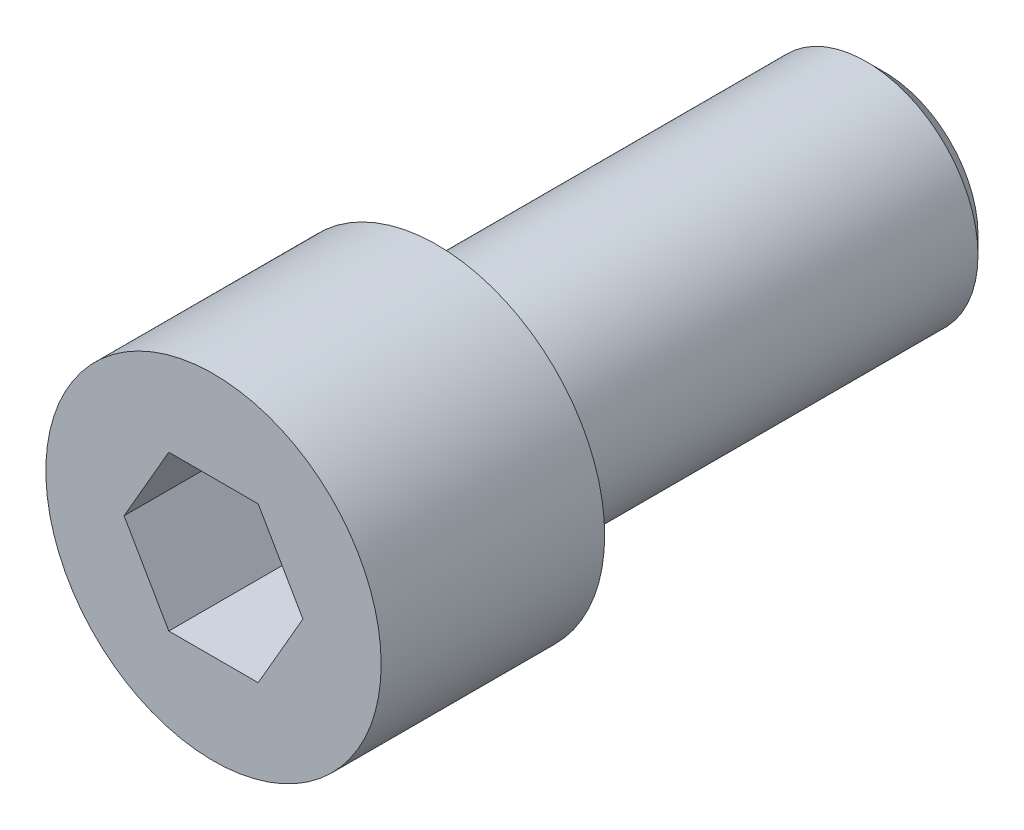
ISO-10303-21;
HEADER;
FILE_DESCRIPTION(('STEP AP214'),'2;1');
FILE_NAME('part.step','',(''),(''),'','','');
FILE_SCHEMA(('AUTOMOTIVE_DESIGN { 1 0 10303 214 1 1 1 1 }'));
ENDSEC;
DATA;
#1=APPLICATION_CONTEXT('core data for automotive mechanical design processes');
#2=APPLICATION_PROTOCOL_DEFINITION('international standard','automotive_design',2000,#1);
#3=PRODUCT_CONTEXT('',#1,'mechanical');
#4=PRODUCT('Part','Part','',(#3));
#5=PRODUCT_RELATED_PRODUCT_CATEGORY('part','',(#4));
#6=PRODUCT_DEFINITION_FORMATION('','',#4);
#7=PRODUCT_DEFINITION_CONTEXT('part definition',#1,'design');
#8=PRODUCT_DEFINITION('design','',#6,#7);
#9=PRODUCT_DEFINITION_SHAPE('','',#8);
#10=(LENGTH_UNIT() NAMED_UNIT(*) SI_UNIT(.MILLI.,.METRE.));
#11=(NAMED_UNIT(*) PLANE_ANGLE_UNIT() SI_UNIT($,.RADIAN.));
#12=(NAMED_UNIT(*) SI_UNIT($,.STERADIAN.) SOLID_ANGLE_UNIT());
#13=UNCERTAINTY_MEASURE_WITH_UNIT(LENGTH_MEASURE(1.E-05),#10,'distance_accuracy_value','');
#14=(GEOMETRIC_REPRESENTATION_CONTEXT(3) GLOBAL_UNCERTAINTY_ASSIGNED_CONTEXT((#13)) GLOBAL_UNIT_ASSIGNED_CONTEXT((#10,
#11,#12)) REPRESENTATION_CONTEXT('',''));
#15=CARTESIAN_POINT('',(0.,0.,0.));
#16=DIRECTION('',(0.,0.,1.));
#17=DIRECTION('',(1.,0.,0.));
#18=AXIS2_PLACEMENT_3D('',#15,#16,#17);
#19=CARTESIAN_POINT('',(0.,0.,0.));
#20=DIRECTION('',(0.,0.,1.));
#21=DIRECTION('',(1.,0.,0.));
#22=AXIS2_PLACEMENT_3D('',#19,#20,#21);
#23=PLANE('',#22);
#24=DIRECTION('',(0.5,0.866025403784439,0.));
#25=VECTOR('',#24,1.);
#26=CARTESIAN_POINT('',(0.5,-0.866025403784439,0.));
#27=LINE('',#26,#25);
#28=CARTESIAN_POINT('',(0.5,-0.866025403784439,0.));
#29=VERTEX_POINT('',#28);
#30=CARTESIAN_POINT('',(1.,0.,0.));
#31=VERTEX_POINT('',#30);
#32=EDGE_CURVE('E51',#29,#31,#27,.T.);
#33=ORIENTED_EDGE('',*,*,#32,.F.);
#34=DIRECTION('',(1.,0.,0.));
#35=VECTOR('',#34,1.);
#36=CARTESIAN_POINT('',(-0.5,-0.866025403784439,0.));
#37=LINE('',#36,#35);
#38=CARTESIAN_POINT('',(-0.5,-0.866025403784439,0.));
#39=VERTEX_POINT('',#38);
#40=EDGE_CURVE('E134',#39,#29,#37,.T.);
#41=ORIENTED_EDGE('',*,*,#40,.F.);
#42=DIRECTION('',(0.5,-0.866025403784439,0.));
#43=VECTOR('',#42,1.);
#44=CARTESIAN_POINT('',(-1.,0.,0.));
#45=LINE('',#44,#43);
#46=CARTESIAN_POINT('',(-1.,0.,0.));
#47=VERTEX_POINT('',#46);
#48=EDGE_CURVE('E132',#47,#39,#45,.T.);
#49=ORIENTED_EDGE('',*,*,#48,.F.);
#50=DIRECTION('',(-0.5,-0.866025403784439,0.));
#51=VECTOR('',#50,1.);
#52=CARTESIAN_POINT('',(-0.5,0.866025403784439,0.));
#53=LINE('',#52,#51);
#54=CARTESIAN_POINT('',(-0.5,0.866025403784439,0.));
#55=VERTEX_POINT('',#54);
#56=EDGE_CURVE('E99',#55,#47,#53,.T.);
#57=ORIENTED_EDGE('',*,*,#56,.F.);
#58=DIRECTION('',(-1.,0.,0.));
#59=VECTOR('',#58,1.);
#60=CARTESIAN_POINT('',(0.5,0.866025403784439,0.));
#61=LINE('',#60,#59);
#62=CARTESIAN_POINT('',(0.5,0.866025403784439,0.));
#63=VERTEX_POINT('',#62);
#64=EDGE_CURVE('E128',#63,#55,#61,.T.);
#65=ORIENTED_EDGE('',*,*,#64,.F.);
#66=DIRECTION('',(-0.5,0.866025403784439,0.));
#67=VECTOR('',#66,1.);
#68=CARTESIAN_POINT('',(1.,0.,0.));
#69=LINE('',#68,#67);
#70=EDGE_CURVE('E125',#31,#63,#69,.T.);
#71=ORIENTED_EDGE('',*,*,#70,.F.);
#72=EDGE_LOOP('',(#33,#41,#49,#57,#65,#71));
#73=FACE_BOUND('',#72,.T.);
#74=CARTESIAN_POINT('',(0.,0.,0.));
#75=DIRECTION('',(0.,0.,1.));
#76=DIRECTION('',(1.,0.,0.));
#77=AXIS2_PLACEMENT_3D('',#74,#75,#76);
#78=CIRCLE('',#77,1.875);
#79=CARTESIAN_POINT('',(1.875,0.,0.));
#80=VERTEX_POINT('',#79);
#81=EDGE_CURVE('E146',#80,#80,#78,.T.);
#82=ORIENTED_EDGE('',*,*,#81,.T.);
#83=EDGE_LOOP('',(#82));
#84=FACE_BOUND('',#83,.T.);
#85=ADVANCED_FACE('F35',(#73,#84),#23,.T.);
#86=CARTESIAN_POINT('',(0.,0.,-2.5));
#87=DIRECTION('',(0.,0.,1.));
#88=DIRECTION('',(1.,0.,0.));
#89=AXIS2_PLACEMENT_3D('',#86,#87,#88);
#90=CYLINDRICAL_SURFACE('',#89,1.875);
#91=CARTESIAN_POINT('',(0.,0.,-2.5));
#92=DIRECTION('',(0.,0.,1.));
#93=DIRECTION('',(1.,0.,0.));
#94=AXIS2_PLACEMENT_3D('',#91,#92,#93);
#95=CIRCLE('',#94,1.875);
#96=CARTESIAN_POINT('',(1.875,0.,-2.5));
#97=VERTEX_POINT('',#96);
#98=EDGE_CURVE('E138',#97,#97,#95,.T.);
#99=ORIENTED_EDGE('',*,*,#98,.T.);
#100=EDGE_LOOP('',(#99));
#101=FACE_BOUND('',#100,.T.);
#102=ORIENTED_EDGE('',*,*,#81,.F.);
#103=EDGE_LOOP('',(#102));
#104=FACE_BOUND('',#103,.T.);
#105=ADVANCED_FACE('F169',(#101,#104),#90,.T.);
#106=CARTESIAN_POINT('',(0.,0.,-2.5));
#107=DIRECTION('',(0.,0.,1.));
#108=DIRECTION('',(1.,0.,0.));
#109=AXIS2_PLACEMENT_3D('',#106,#107,#108);
#110=PLANE('',#109);
#111=CARTESIAN_POINT('',(0.,0.,-2.5));
#112=DIRECTION('',(0.,0.,1.));
#113=DIRECTION('',(1.,0.,0.));
#114=AXIS2_PLACEMENT_3D('',#111,#112,#113);
#115=CIRCLE('',#114,1.4);
#116=CARTESIAN_POINT('',(1.4,0.,-2.5));
#117=VERTEX_POINT('',#116);
#118=EDGE_CURVE('E149',#117,#117,#115,.T.);
#119=ORIENTED_EDGE('',*,*,#118,.T.);
#120=EDGE_LOOP('',(#119));
#121=FACE_BOUND('',#120,.T.);
#122=ORIENTED_EDGE('',*,*,#98,.F.);
#123=EDGE_LOOP('',(#122));
#124=FACE_BOUND('',#123,.T.);
#125=ADVANCED_FACE('F175',(#121,#124),#110,.F.);
#126=CARTESIAN_POINT('',(0.,0.,-2.5));
#127=DIRECTION('',(0.,0.,1.));
#128=DIRECTION('',(1.,0.,0.));
#129=AXIS2_PLACEMENT_3D('',#126,#127,#128);
#130=CYLINDRICAL_SURFACE('',#129,1.25);
#131=CARTESIAN_POINT('',(0.,0.,-7.3));
#132=DIRECTION('',(0.,0.,1.));
#133=DIRECTION('',(1.,0.,0.));
#134=AXIS2_PLACEMENT_3D('',#131,#132,#133);
#135=CIRCLE('',#134,1.25);
#136=CARTESIAN_POINT('',(1.25,0.,-7.3));
#137=VERTEX_POINT('',#136);
#138=EDGE_CURVE('E44',#137,#137,#135,.T.);
#139=ORIENTED_EDGE('',*,*,#138,.T.);
#140=EDGE_LOOP('',(#139));
#141=FACE_BOUND('',#140,.T.);
#142=CARTESIAN_POINT('',(0.,0.,-2.65));
#143=DIRECTION('',(0.,0.,1.));
#144=DIRECTION('',(1.,0.,0.));
#145=AXIS2_PLACEMENT_3D('',#142,#143,#144);
#146=CIRCLE('',#145,1.25);
#147=CARTESIAN_POINT('',(1.25,0.,-2.65));
#148=VERTEX_POINT('',#147);
#149=EDGE_CURVE('E152',#148,#148,#146,.F.);
#150=ORIENTED_EDGE('',*,*,#149,.T.);
#151=EDGE_LOOP('',(#150));
#152=FACE_BOUND('',#151,.T.);
#153=ADVANCED_FACE('F157',(#141,#152),#130,.T.);
#154=CARTESIAN_POINT('',(0.,0.,-7.5));
#155=DIRECTION('',(0.,0.,1.));
#156=DIRECTION('',(1.,0.,0.));
#157=AXIS2_PLACEMENT_3D('',#154,#155,#156);
#158=PLANE('',#157);
#159=CARTESIAN_POINT('',(0.,0.,-7.5));
#160=DIRECTION('',(0.,0.,1.));
#161=DIRECTION('',(1.,0.,0.));
#162=AXIS2_PLACEMENT_3D('',#159,#160,#161);
#163=CIRCLE('',#162,1.05000000000001);
#164=CARTESIAN_POINT('',(1.05000000000001,0.,-7.5));
#165=VERTEX_POINT('',#164);
#166=EDGE_CURVE('E11',#165,#165,#163,.F.);
#167=ORIENTED_EDGE('',*,*,#166,.T.);
#168=EDGE_LOOP('',(#167));
#169=FACE_BOUND('',#168,.T.);
#170=ADVANCED_FACE('F185',(#169),#158,.F.);
#171=CARTESIAN_POINT('',(0.5,-0.866025403784439,-1.5));
#172=DIRECTION('',(0.866025403784439,-0.5,0.));
#173=DIRECTION('',(0.5,0.866025403784439,0.));
#174=AXIS2_PLACEMENT_3D('',#171,#172,#173);
#175=PLANE('',#174);
#176=ORIENTED_EDGE('',*,*,#32,.T.);
#177=DIRECTION('',(0.,0.,1.));
#178=VECTOR('',#177,1.);
#179=CARTESIAN_POINT('',(1.,0.,-1.5));
#180=LINE('',#179,#178);
#181=CARTESIAN_POINT('',(1.,0.,-1.5));
#182=VERTEX_POINT('',#181);
#183=EDGE_CURVE('E81',#182,#31,#180,.T.);
#184=ORIENTED_EDGE('',*,*,#183,.F.);
#185=DIRECTION('',(0.5,0.866025403784439,0.));
#186=VECTOR('',#185,1.);
#187=CARTESIAN_POINT('',(0.5,-0.866025403784439,-1.5));
#188=LINE('',#187,#186);
#189=CARTESIAN_POINT('',(0.5,-0.866025403784439,-1.5));
#190=VERTEX_POINT('',#189);
#191=EDGE_CURVE('E136',#190,#182,#188,.T.);
#192=ORIENTED_EDGE('',*,*,#191,.F.);
#193=DIRECTION('',(0.,0.,1.));
#194=VECTOR('',#193,1.);
#195=CARTESIAN_POINT('',(0.5,-0.866025403784439,-1.5));
#196=LINE('',#195,#194);
#197=EDGE_CURVE('E59',#190,#29,#196,.T.);
#198=ORIENTED_EDGE('',*,*,#197,.T.);
#199=EDGE_LOOP('',(#176,#184,#192,#198));
#200=FACE_BOUND('',#199,.T.);
#201=ADVANCED_FACE('F188',(#200),#175,.F.);
#202=CARTESIAN_POINT('',(-0.5,-0.866025403784439,-1.5));
#203=DIRECTION('',(0.,-1.,0.));
#204=DIRECTION('',(1.,0.,0.));
#205=AXIS2_PLACEMENT_3D('',#202,#203,#204);
#206=PLANE('',#205);
#207=ORIENTED_EDGE('',*,*,#40,.T.);
#208=ORIENTED_EDGE('',*,*,#197,.F.);
#209=DIRECTION('',(1.,0.,0.));
#210=VECTOR('',#209,1.);
#211=CARTESIAN_POINT('',(-0.5,-0.866025403784439,-1.5));
#212=LINE('',#211,#210);
#213=CARTESIAN_POINT('',(-0.5,-0.866025403784439,-1.5));
#214=VERTEX_POINT('',#213);
#215=EDGE_CURVE('E111',#214,#190,#212,.T.);
#216=ORIENTED_EDGE('',*,*,#215,.F.);
#217=DIRECTION('',(0.,0.,1.));
#218=VECTOR('',#217,1.);
#219=CARTESIAN_POINT('',(-0.5,-0.866025403784439,-1.5));
#220=LINE('',#219,#218);
#221=EDGE_CURVE('E103',#214,#39,#220,.T.);
#222=ORIENTED_EDGE('',*,*,#221,.T.);
#223=EDGE_LOOP('',(#207,#208,#216,#222));
#224=FACE_BOUND('',#223,.T.);
#225=ADVANCED_FACE('F192',(#224),#206,.F.);
#226=CARTESIAN_POINT('',(-1.,0.,-1.5));
#227=DIRECTION('',(-0.866025403784439,-0.5,0.));
#228=DIRECTION('',(0.5,-0.866025403784439,0.));
#229=AXIS2_PLACEMENT_3D('',#226,#227,#228);
#230=PLANE('',#229);
#231=ORIENTED_EDGE('',*,*,#48,.T.);
#232=ORIENTED_EDGE('',*,*,#221,.F.);
#233=DIRECTION('',(0.5,-0.866025403784439,0.));
#234=VECTOR('',#233,1.);
#235=CARTESIAN_POINT('',(-1.,0.,-1.5));
#236=LINE('',#235,#234);
#237=CARTESIAN_POINT('',(-1.,0.,-1.5));
#238=VERTEX_POINT('',#237);
#239=EDGE_CURVE('E107',#238,#214,#236,.T.);
#240=ORIENTED_EDGE('',*,*,#239,.F.);
#241=DIRECTION('',(0.,0.,1.));
#242=VECTOR('',#241,1.);
#243=CARTESIAN_POINT('',(-1.,0.,-1.5));
#244=LINE('',#243,#242);
#245=EDGE_CURVE('E92',#238,#47,#244,.T.);
#246=ORIENTED_EDGE('',*,*,#245,.T.);
#247=EDGE_LOOP('',(#231,#232,#240,#246));
#248=FACE_BOUND('',#247,.T.);
#249=ADVANCED_FACE('F108',(#248),#230,.F.);
#250=CARTESIAN_POINT('',(-0.5,0.866025403784439,-1.5));
#251=DIRECTION('',(-0.866025403784439,0.5,0.));
#252=DIRECTION('',(-0.5,-0.866025403784439,0.));
#253=AXIS2_PLACEMENT_3D('',#250,#251,#252);
#254=PLANE('',#253);
#255=ORIENTED_EDGE('',*,*,#56,.T.);
#256=ORIENTED_EDGE('',*,*,#245,.F.);
#257=DIRECTION('',(-0.5,-0.866025403784439,0.));
#258=VECTOR('',#257,1.);
#259=CARTESIAN_POINT('',(-0.5,0.866025403784439,-1.5));
#260=LINE('',#259,#258);
#261=CARTESIAN_POINT('',(-0.5,0.866025403784439,-1.5));
#262=VERTEX_POINT('',#261);
#263=EDGE_CURVE('E96',#262,#238,#260,.T.);
#264=ORIENTED_EDGE('',*,*,#263,.F.);
#265=DIRECTION('',(0.,0.,1.));
#266=VECTOR('',#265,1.);
#267=CARTESIAN_POINT('',(-0.5,0.866025403784439,-1.5));
#268=LINE('',#267,#266);
#269=EDGE_CURVE('E104',#262,#55,#268,.T.);
#270=ORIENTED_EDGE('',*,*,#269,.T.);
#271=EDGE_LOOP('',(#255,#256,#264,#270));
#272=FACE_BOUND('',#271,.T.);
#273=ADVANCED_FACE('F94',(#272),#254,.F.);
#274=CARTESIAN_POINT('',(0.5,0.866025403784439,-1.5));
#275=DIRECTION('',(0.,1.,0.));
#276=DIRECTION('',(0.,0.,1.));
#277=AXIS2_PLACEMENT_3D('',#274,#275,#276);
#278=PLANE('',#277);
#279=ORIENTED_EDGE('',*,*,#64,.T.);
#280=ORIENTED_EDGE('',*,*,#269,.F.);
#281=DIRECTION('',(-1.,0.,0.));
#282=VECTOR('',#281,1.);
#283=CARTESIAN_POINT('',(0.5,0.866025403784439,-1.5));
#284=LINE('',#283,#282);
#285=CARTESIAN_POINT('',(0.5,0.866025403784439,-1.5));
#286=VERTEX_POINT('',#285);
#287=EDGE_CURVE('E117',#286,#262,#284,.T.);
#288=ORIENTED_EDGE('',*,*,#287,.F.);
#289=DIRECTION('',(0.,0.,1.));
#290=VECTOR('',#289,1.);
#291=CARTESIAN_POINT('',(0.5,0.866025403784439,-1.5));
#292=LINE('',#291,#290);
#293=EDGE_CURVE('E141',#286,#63,#292,.T.);
#294=ORIENTED_EDGE('',*,*,#293,.T.);
#295=EDGE_LOOP('',(#279,#280,#288,#294));
#296=FACE_BOUND('',#295,.T.);
#297=ADVANCED_FACE('F196',(#296),#278,.F.);
#298=CARTESIAN_POINT('',(1.,0.,-1.5));
#299=DIRECTION('',(0.866025403784439,0.5,0.));
#300=DIRECTION('',(-0.5,0.866025403784439,0.));
#301=AXIS2_PLACEMENT_3D('',#298,#299,#300);
#302=PLANE('',#301);
#303=ORIENTED_EDGE('',*,*,#70,.T.);
#304=ORIENTED_EDGE('',*,*,#293,.F.);
#305=DIRECTION('',(-0.5,0.866025403784439,0.));
#306=VECTOR('',#305,1.);
#307=CARTESIAN_POINT('',(1.,0.,-1.5));
#308=LINE('',#307,#306);
#309=EDGE_CURVE('E119',#182,#286,#308,.T.);
#310=ORIENTED_EDGE('',*,*,#309,.F.);
#311=ORIENTED_EDGE('',*,*,#183,.T.);
#312=EDGE_LOOP('',(#303,#304,#310,#311));
#313=FACE_BOUND('',#312,.T.);
#314=ADVANCED_FACE('F193',(#313),#302,.F.);
#315=CARTESIAN_POINT('',(0.,0.,-1.5));
#316=DIRECTION('',(0.,0.,1.));
#317=DIRECTION('',(1.,0.,0.));
#318=AXIS2_PLACEMENT_3D('',#315,#316,#317);
#319=PLANE('',#318);
#320=ORIENTED_EDGE('',*,*,#191,.T.);
#321=ORIENTED_EDGE('',*,*,#309,.T.);
#322=ORIENTED_EDGE('',*,*,#287,.T.);
#323=ORIENTED_EDGE('',*,*,#263,.T.);
#324=ORIENTED_EDGE('',*,*,#239,.T.);
#325=ORIENTED_EDGE('',*,*,#215,.T.);
#326=EDGE_LOOP('',(#320,#321,#322,#323,#324,#325));
#327=FACE_BOUND('',#326,.T.);
#328=ADVANCED_FACE('F114',(#327),#319,.T.);
#329=CARTESIAN_POINT('',(0.,0.,-2.65));
#330=DIRECTION('',(0.,0.,1.));
#331=DIRECTION('',(1.,0.,0.));
#332=AXIS2_PLACEMENT_3D('',#329,#330,#331);
#333=TOROIDAL_SURFACE('',#332,1.4,0.15);
#334=ORIENTED_EDGE('',*,*,#149,.F.);
#335=EDGE_LOOP('',(#334));
#336=FACE_BOUND('',#335,.T.);
#337=ORIENTED_EDGE('',*,*,#118,.F.);
#338=EDGE_LOOP('',(#337));
#339=FACE_BOUND('',#338,.T.);
#340=ADVANCED_FACE('F161',(#336,#339),#333,.F.);
#341=CARTESIAN_POINT('',(0.,0.,-7.3));
#342=DIRECTION('',(0.,0.,1.));
#343=DIRECTION('',(1.,0.,0.));
#344=AXIS2_PLACEMENT_3D('',#341,#342,#343);
#345=CONICAL_SURFACE('',#344,1.25,0.785398163397453);
#346=ORIENTED_EDGE('',*,*,#166,.F.);
#347=EDGE_LOOP('',(#346));
#348=FACE_BOUND('',#347,.T.);
#349=ORIENTED_EDGE('',*,*,#138,.F.);
#350=EDGE_LOOP('',(#349));
#351=FACE_BOUND('',#350,.T.);
#352=ADVANCED_FACE('F38',(#348,#351),#345,.T.);
#353=CLOSED_SHELL('',(#85,#105,#125,#153,#170,#201,#225,#249,#273,#297,#314,#328,#340,#352));
#354=MANIFOLD_SOLID_BREP('B2',#353);
#355=ADVANCED_BREP_SHAPE_REPRESENTATION('',(#18,#354),#14);
#356=SHAPE_DEFINITION_REPRESENTATION(#9,#355);
ENDSEC;
END-ISO-10303-21;
